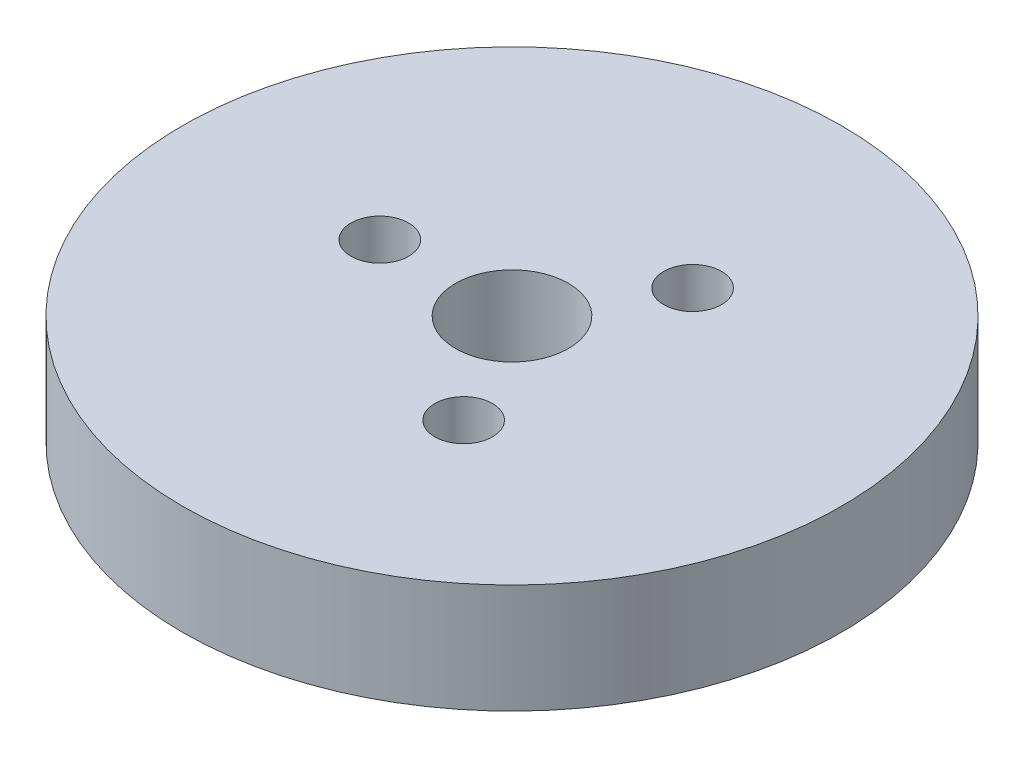
ISO-10303-21;
HEADER;
FILE_DESCRIPTION(('STEP AP214'),'2;1');
FILE_NAME('part.step','',(''),(''),'','','');
FILE_SCHEMA(('AUTOMOTIVE_DESIGN { 1 0 10303 214 1 1 1 1 }'));
ENDSEC;
DATA;
#1=APPLICATION_CONTEXT('core data for automotive mechanical design processes');
#2=APPLICATION_PROTOCOL_DEFINITION('international standard','automotive_design',2000,#1);
#3=PRODUCT_CONTEXT('',#1,'mechanical');
#4=PRODUCT('Part','Part','',(#3));
#5=PRODUCT_RELATED_PRODUCT_CATEGORY('part','',(#4));
#6=PRODUCT_DEFINITION_FORMATION('','',#4);
#7=PRODUCT_DEFINITION_CONTEXT('part definition',#1,'design');
#8=PRODUCT_DEFINITION('design','',#6,#7);
#9=PRODUCT_DEFINITION_SHAPE('','',#8);
#10=(LENGTH_UNIT() NAMED_UNIT(*) SI_UNIT(.MILLI.,.METRE.));
#11=(NAMED_UNIT(*) PLANE_ANGLE_UNIT() SI_UNIT($,.RADIAN.));
#12=(NAMED_UNIT(*) SI_UNIT($,.STERADIAN.) SOLID_ANGLE_UNIT());
#13=UNCERTAINTY_MEASURE_WITH_UNIT(LENGTH_MEASURE(1.E-05),#10,'distance_accuracy_value','');
#14=(GEOMETRIC_REPRESENTATION_CONTEXT(3) GLOBAL_UNCERTAINTY_ASSIGNED_CONTEXT((#13)) GLOBAL_UNIT_ASSIGNED_CONTEXT((#10,
#11,#12)) REPRESENTATION_CONTEXT('',''));
#15=CARTESIAN_POINT('',(0.,0.,0.));
#16=DIRECTION('',(0.,0.,1.));
#17=DIRECTION('',(1.,0.,0.));
#18=AXIS2_PLACEMENT_3D('',#15,#16,#17);
#19=CARTESIAN_POINT('',(0.,29.,0.));
#20=DIRECTION('',(0.,-1.,0.));
#21=DIRECTION('',(0.,0.,-1.));
#22=AXIS2_PLACEMENT_3D('',#19,#20,#21);
#23=CYLINDRICAL_SURFACE('',#22,87.5);
#24=CARTESIAN_POINT('',(0.,29.,0.));
#25=DIRECTION('',(0.,1.,0.));
#26=DIRECTION('',(0.,0.,1.));
#27=AXIS2_PLACEMENT_3D('',#24,#25,#26);
#28=CIRCLE('',#27,87.5);
#29=CARTESIAN_POINT('',(0.,29.,-87.5));
#30=VERTEX_POINT('',#29);
#31=EDGE_CURVE('E10',#30,#30,#28,.T.);
#32=CARTESIAN_POINT('',(0.,0.,0.));
#33=DIRECTION('',(0.,1.,0.));
#34=DIRECTION('',(0.,0.,1.));
#35=AXIS2_PLACEMENT_3D('',#32,#33,#34);
#36=CIRCLE('',#35,87.5);
#37=CARTESIAN_POINT('',(0.,0.,-87.5));
#38=VERTEX_POINT('',#37);
#39=EDGE_CURVE('E37',#38,#38,#36,.T.);
#40=CARTESIAN_POINT('',(0.,29.,-87.5));
#41=CARTESIAN_POINT('',(0.,28.6979166666667,-87.5));
#42=CARTESIAN_POINT('',(0.,28.3958333333333,-87.5));
#43=CARTESIAN_POINT('',(0.,27.7916666666667,-87.5));
#44=CARTESIAN_POINT('',(0.,27.4895833333333,-87.5));
#45=CARTESIAN_POINT('',(0.,26.8854166666667,-87.5));
#46=CARTESIAN_POINT('',(0.,26.5833333333333,-87.5));
#47=CARTESIAN_POINT('',(0.,25.9791666666667,-87.5));
#48=CARTESIAN_POINT('',(0.,25.6770833333333,-87.5));
#49=CARTESIAN_POINT('',(0.,25.0729166666667,-87.5));
#50=CARTESIAN_POINT('',(0.,24.7708333333333,-87.5));
#51=CARTESIAN_POINT('',(0.,24.1666666666667,-87.5));
#52=CARTESIAN_POINT('',(0.,23.8645833333333,-87.5));
#53=CARTESIAN_POINT('',(0.,23.2604166666667,-87.5));
#54=CARTESIAN_POINT('',(0.,22.9583333333333,-87.5));
#55=CARTESIAN_POINT('',(0.,22.3541666666667,-87.5));
#56=CARTESIAN_POINT('',(0.,22.0520833333333,-87.5));
#57=CARTESIAN_POINT('',(0.,21.4479166666667,-87.5));
#58=CARTESIAN_POINT('',(0.,21.1458333333333,-87.5));
#59=CARTESIAN_POINT('',(0.,20.5416666666667,-87.5));
#60=CARTESIAN_POINT('',(0.,20.2395833333333,-87.5));
#61=CARTESIAN_POINT('',(0.,19.6354166666667,-87.5));
#62=CARTESIAN_POINT('',(0.,19.3333333333333,-87.5));
#63=CARTESIAN_POINT('',(0.,18.7291666666667,-87.5));
#64=CARTESIAN_POINT('',(0.,18.4270833333333,-87.5));
#65=CARTESIAN_POINT('',(0.,17.8229166666667,-87.5));
#66=CARTESIAN_POINT('',(0.,17.5208333333333,-87.5));
#67=CARTESIAN_POINT('',(0.,16.9166666666667,-87.5));
#68=CARTESIAN_POINT('',(0.,16.6145833333333,-87.5));
#69=CARTESIAN_POINT('',(0.,16.0104166666667,-87.5));
#70=CARTESIAN_POINT('',(0.,15.7083333333333,-87.5));
#71=CARTESIAN_POINT('',(0.,15.1041666666667,-87.5));
#72=CARTESIAN_POINT('',(0.,14.8020833333333,-87.5));
#73=CARTESIAN_POINT('',(0.,14.1979166666667,-87.5));
#74=CARTESIAN_POINT('',(0.,13.8958333333333,-87.5));
#75=CARTESIAN_POINT('',(0.,13.2916666666667,-87.5));
#76=CARTESIAN_POINT('',(0.,12.9895833333333,-87.5));
#77=CARTESIAN_POINT('',(0.,12.3854166666667,-87.5));
#78=CARTESIAN_POINT('',(0.,12.0833333333333,-87.5));
#79=CARTESIAN_POINT('',(0.,11.4791666666667,-87.5));
#80=CARTESIAN_POINT('',(0.,11.1770833333333,-87.5));
#81=CARTESIAN_POINT('',(0.,10.5729166666667,-87.5));
#82=CARTESIAN_POINT('',(0.,10.2708333333333,-87.5));
#83=CARTESIAN_POINT('',(0.,9.66666666666667,-87.5));
#84=CARTESIAN_POINT('',(0.,9.36458333333333,-87.5));
#85=CARTESIAN_POINT('',(0.,8.76041666666667,-87.5));
#86=CARTESIAN_POINT('',(0.,8.45833333333333,-87.5));
#87=CARTESIAN_POINT('',(0.,7.85416666666667,-87.5));
#88=CARTESIAN_POINT('',(0.,7.55208333333333,-87.5));
#89=CARTESIAN_POINT('',(0.,6.94791666666667,-87.5));
#90=CARTESIAN_POINT('',(0.,6.64583333333333,-87.5));
#91=CARTESIAN_POINT('',(0.,6.04166666666667,-87.5));
#92=CARTESIAN_POINT('',(0.,5.73958333333333,-87.5));
#93=CARTESIAN_POINT('',(0.,5.13541666666667,-87.5));
#94=CARTESIAN_POINT('',(0.,4.83333333333333,-87.5));
#95=CARTESIAN_POINT('',(0.,4.22916666666667,-87.5));
#96=CARTESIAN_POINT('',(0.,3.92708333333333,-87.5));
#97=CARTESIAN_POINT('',(0.,3.32291666666667,-87.5));
#98=CARTESIAN_POINT('',(0.,3.02083333333333,-87.5));
#99=CARTESIAN_POINT('',(0.,2.41666666666667,-87.5));
#100=CARTESIAN_POINT('',(0.,2.11458333333333,-87.5));
#101=CARTESIAN_POINT('',(0.,1.51041666666667,-87.5));
#102=CARTESIAN_POINT('',(0.,1.20833333333333,-87.5));
#103=CARTESIAN_POINT('',(0.,0.604166666666667,-87.5));
#104=CARTESIAN_POINT('',(0.,0.302083333333333,-87.5));
#105=CARTESIAN_POINT('',(0.,0.,-87.5));
#106=B_SPLINE_CURVE_WITH_KNOTS('',3,(#40,#41,#42,#43,#44,#45,#46,#47,#48,#49,#50,#51,#52,#53,
#54,#55,#56,#57,#58,#59,#60,#61,#62,#63,#64,#65,#66,#67,#68,#69,#70,#71,#72,#73,#74,#75,#76,#77,
#78,#79,#80,#81,#82,#83,#84,#85,#86,#87,#88,#89,#90,#91,#92,#93,#94,#95,#96,#97,#98,#99,#100,
#101,#102,#103,#104,#105),.UNSPECIFIED.,.F.,.F.,(4,2,2,2,2,2,2,2,2,2,2,2,2,2,2,2,2,2,2,2,2,2,2,
2,2,2,2,2,2,2,2,2,4),(0.,0.906249999999997,1.8125,2.71875,3.625,4.53125,5.4375,6.34375,7.25,
8.15625,9.0625,9.96875,10.875,11.78125,12.6875,13.59375,14.5,15.40625,16.3125,17.21875,18.125,
19.03125,19.9375,20.84375,21.75,22.65625,23.5625,24.46875,25.375,26.28125,27.1875,28.09375,29.),.UNSPECIFIED.);
#107=EDGE_CURVE('BSEAM40',#30,#38,#106,.T.);
#108=ORIENTED_EDGE('',*,*,#31,.F.);
#109=ORIENTED_EDGE('',*,*,#39,.T.);
#110=ORIENTED_EDGE('',*,*,#107,.T.);
#111=ORIENTED_EDGE('',*,*,#107,.F.);
#112=EDGE_LOOP('',(#108,#110,#109,#111));
#113=FACE_BOUND('',#112,.T.);
#114=ADVANCED_FACE('F40',(#113),#23,.T.);
#115=CARTESIAN_POINT('',(0.,29.,0.));
#116=DIRECTION('',(0.,1.,0.));
#117=DIRECTION('',(0.,0.,1.));
#118=AXIS2_PLACEMENT_3D('',#115,#116,#117);
#119=PLANE('',#118);
#120=CARTESIAN_POINT('',(17.5471963072202,29.,30.39263553449));
#121=DIRECTION('',(0.,1.,0.));
#122=DIRECTION('',(0.866025403784436,0.,-0.500000000000004));
#123=AXIS2_PLACEMENT_3D('',#120,#121,#122);
#124=CIRCLE('',#123,7.66698889306709);
#125=CARTESIAN_POINT('',(24.1870034591494,29.,26.5591410879564));
#126=VERTEX_POINT('',#125);
#127=EDGE_CURVE('E70',#126,#126,#124,.T.);
#128=ORIENTED_EDGE('',*,*,#127,.F.);
#129=EDGE_LOOP('',(#128));
#130=FACE_BOUND('',#129,.T.);
#131=CARTESIAN_POINT('',(17.5471963072197,29.,-30.3926355344902));
#132=DIRECTION('',(0.,1.,0.));
#133=DIRECTION('',(-0.866025403784443,0.,-0.499999999999992));
#134=AXIS2_PLACEMENT_3D('',#131,#132,#133);
#135=CIRCLE('',#134,7.66698889306709);
#136=CARTESIAN_POINT('',(10.9073891552905,29.,-34.2261299810237));
#137=VERTEX_POINT('',#136);
#138=EDGE_CURVE('E61',#137,#137,#135,.T.);
#139=ORIENTED_EDGE('',*,*,#138,.F.);
#140=EDGE_LOOP('',(#139));
#141=FACE_BOUND('',#140,.T.);
#142=CARTESIAN_POINT('',(-35.0943926144401,29.,0.));
#143=DIRECTION('',(0.,1.,0.));
#144=DIRECTION('',(0.,0.,1.));
#145=AXIS2_PLACEMENT_3D('',#142,#143,#144);
#146=CIRCLE('',#145,7.66698889306709);
#147=CARTESIAN_POINT('',(-35.0943926144401,29.,7.66698889306709));
#148=VERTEX_POINT('',#147);
#149=EDGE_CURVE('E54',#148,#148,#146,.T.);
#150=ORIENTED_EDGE('',*,*,#149,.F.);
#151=EDGE_LOOP('',(#150));
#152=FACE_BOUND('',#151,.T.);
#153=CARTESIAN_POINT('',(0.,29.,0.));
#154=DIRECTION('',(0.,1.,0.));
#155=DIRECTION('',(0.,0.,1.));
#156=AXIS2_PLACEMENT_3D('',#153,#154,#155);
#157=CIRCLE('',#156,15.);
#158=CARTESIAN_POINT('',(0.,29.,-15.));
#159=VERTEX_POINT('',#158);
#160=EDGE_CURVE('E50',#159,#159,#157,.T.);
#161=ORIENTED_EDGE('',*,*,#160,.F.);
#162=EDGE_LOOP('',(#161));
#163=FACE_BOUND('',#162,.T.);
#164=ORIENTED_EDGE('',*,*,#31,.T.);
#165=EDGE_LOOP('',(#164));
#166=FACE_BOUND('',#165,.T.);
#167=ADVANCED_FACE('F85',(#130,#141,#152,#163,#166),#119,.T.);
#168=CARTESIAN_POINT('',(0.,0.,0.));
#169=DIRECTION('',(0.,1.,0.));
#170=DIRECTION('',(0.,0.,1.));
#171=AXIS2_PLACEMENT_3D('',#168,#169,#170);
#172=PLANE('',#171);
#173=CARTESIAN_POINT('',(0.,0.,0.));
#174=DIRECTION('',(0.,1.,0.));
#175=DIRECTION('',(0.,0.,1.));
#176=AXIS2_PLACEMENT_3D('',#173,#174,#175);
#177=CIRCLE('',#176,15.);
#178=CARTESIAN_POINT('',(0.,0.,-15.));
#179=VERTEX_POINT('',#178);
#180=EDGE_CURVE('E47',#179,#179,#177,.T.);
#181=ORIENTED_EDGE('',*,*,#180,.T.);
#182=EDGE_LOOP('',(#181));
#183=FACE_BOUND('',#182,.T.);
#184=ORIENTED_EDGE('',*,*,#39,.F.);
#185=EDGE_LOOP('',(#184));
#186=FACE_BOUND('',#185,.T.);
#187=ADVANCED_FACE('F84',(#183,#186),#172,.F.);
#188=CARTESIAN_POINT('',(0.,29.,0.));
#189=DIRECTION('',(0.,-1.,0.));
#190=DIRECTION('',(0.,0.,-1.));
#191=AXIS2_PLACEMENT_3D('',#188,#189,#190);
#192=CYLINDRICAL_SURFACE('',#191,15.);
#193=CARTESIAN_POINT('',(0.,29.,-15.));
#194=CARTESIAN_POINT('',(0.,28.6979166666667,-15.));
#195=CARTESIAN_POINT('',(0.,28.3958333333333,-15.));
#196=CARTESIAN_POINT('',(0.,27.7916666666667,-15.));
#197=CARTESIAN_POINT('',(0.,27.4895833333333,-15.));
#198=CARTESIAN_POINT('',(0.,26.8854166666667,-15.));
#199=CARTESIAN_POINT('',(0.,26.5833333333333,-15.));
#200=CARTESIAN_POINT('',(0.,25.9791666666667,-15.));
#201=CARTESIAN_POINT('',(0.,25.6770833333333,-15.));
#202=CARTESIAN_POINT('',(0.,25.0729166666667,-15.));
#203=CARTESIAN_POINT('',(0.,24.7708333333333,-15.));
#204=CARTESIAN_POINT('',(0.,24.1666666666667,-15.));
#205=CARTESIAN_POINT('',(0.,23.8645833333333,-15.));
#206=CARTESIAN_POINT('',(0.,23.2604166666667,-15.));
#207=CARTESIAN_POINT('',(0.,22.9583333333333,-15.));
#208=CARTESIAN_POINT('',(0.,22.3541666666667,-15.));
#209=CARTESIAN_POINT('',(0.,22.0520833333333,-15.));
#210=CARTESIAN_POINT('',(0.,21.4479166666667,-15.));
#211=CARTESIAN_POINT('',(0.,21.1458333333333,-15.));
#212=CARTESIAN_POINT('',(0.,20.5416666666667,-15.));
#213=CARTESIAN_POINT('',(0.,20.2395833333333,-15.));
#214=CARTESIAN_POINT('',(0.,19.6354166666667,-15.));
#215=CARTESIAN_POINT('',(0.,19.3333333333333,-15.));
#216=CARTESIAN_POINT('',(0.,18.7291666666667,-15.));
#217=CARTESIAN_POINT('',(0.,18.4270833333333,-15.));
#218=CARTESIAN_POINT('',(0.,17.8229166666667,-15.));
#219=CARTESIAN_POINT('',(0.,17.5208333333333,-15.));
#220=CARTESIAN_POINT('',(0.,16.9166666666667,-15.));
#221=CARTESIAN_POINT('',(0.,16.6145833333333,-15.));
#222=CARTESIAN_POINT('',(0.,16.0104166666667,-15.));
#223=CARTESIAN_POINT('',(0.,15.7083333333333,-15.));
#224=CARTESIAN_POINT('',(0.,15.1041666666667,-15.));
#225=CARTESIAN_POINT('',(0.,14.8020833333333,-15.));
#226=CARTESIAN_POINT('',(0.,14.1979166666667,-15.));
#227=CARTESIAN_POINT('',(0.,13.8958333333333,-15.));
#228=CARTESIAN_POINT('',(0.,13.2916666666667,-15.));
#229=CARTESIAN_POINT('',(0.,12.9895833333333,-15.));
#230=CARTESIAN_POINT('',(0.,12.3854166666667,-15.));
#231=CARTESIAN_POINT('',(0.,12.0833333333333,-15.));
#232=CARTESIAN_POINT('',(0.,11.4791666666667,-15.));
#233=CARTESIAN_POINT('',(0.,11.1770833333333,-15.));
#234=CARTESIAN_POINT('',(0.,10.5729166666667,-15.));
#235=CARTESIAN_POINT('',(0.,10.2708333333333,-15.));
#236=CARTESIAN_POINT('',(0.,9.66666666666667,-15.));
#237=CARTESIAN_POINT('',(0.,9.36458333333333,-15.));
#238=CARTESIAN_POINT('',(0.,8.76041666666667,-15.));
#239=CARTESIAN_POINT('',(0.,8.45833333333333,-15.));
#240=CARTESIAN_POINT('',(0.,7.85416666666667,-15.));
#241=CARTESIAN_POINT('',(0.,7.55208333333333,-15.));
#242=CARTESIAN_POINT('',(0.,6.94791666666667,-15.));
#243=CARTESIAN_POINT('',(0.,6.64583333333333,-15.));
#244=CARTESIAN_POINT('',(0.,6.04166666666667,-15.));
#245=CARTESIAN_POINT('',(0.,5.73958333333333,-15.));
#246=CARTESIAN_POINT('',(0.,5.13541666666667,-15.));
#247=CARTESIAN_POINT('',(0.,4.83333333333333,-15.));
#248=CARTESIAN_POINT('',(0.,4.22916666666667,-15.));
#249=CARTESIAN_POINT('',(0.,3.92708333333333,-15.));
#250=CARTESIAN_POINT('',(0.,3.32291666666667,-15.));
#251=CARTESIAN_POINT('',(0.,3.02083333333333,-15.));
#252=CARTESIAN_POINT('',(0.,2.41666666666667,-15.));
#253=CARTESIAN_POINT('',(0.,2.11458333333333,-15.));
#254=CARTESIAN_POINT('',(0.,1.51041666666667,-15.));
#255=CARTESIAN_POINT('',(0.,1.20833333333333,-15.));
#256=CARTESIAN_POINT('',(0.,0.604166666666667,-15.));
#257=CARTESIAN_POINT('',(0.,0.302083333333333,-15.));
#258=CARTESIAN_POINT('',(0.,0.,-15.));
#259=B_SPLINE_CURVE_WITH_KNOTS('',3,(#193,#194,#195,#196,#197,#198,#199,#200,#201,#202,#203,
#204,#205,#206,#207,#208,#209,#210,#211,#212,#213,#214,#215,#216,#217,#218,#219,#220,#221,#222,
#223,#224,#225,#226,#227,#228,#229,#230,#231,#232,#233,#234,#235,#236,#237,#238,#239,#240,#241,
#242,#243,#244,#245,#246,#247,#248,#249,#250,#251,#252,#253,#254,#255,#256,#257,#258),
.UNSPECIFIED.,.F.,.F.,(4,2,2,2,2,2,2,2,2,2,2,2,2,2,2,2,2,2,2,2,2,2,2,2,2,2,2,2,2,2,2,2,4),(0.,
0.906250000000001,1.8125,2.71875,3.625,4.53125,5.4375,6.34375,7.25,8.15625,9.0625,9.96875,
10.875,11.78125,12.6875,13.59375,14.5,15.40625,16.3125,17.21875,18.125,19.03125,19.9375,
20.84375,21.75,22.65625,23.5625,24.46875,25.375,26.28125,27.1875,28.09375,29.),.UNSPECIFIED.);
#260=EDGE_CURVE('BSEAM91',#159,#179,#259,.T.);
#261=ORIENTED_EDGE('',*,*,#160,.T.);
#262=ORIENTED_EDGE('',*,*,#180,.F.);
#263=ORIENTED_EDGE('',*,*,#260,.T.);
#264=ORIENTED_EDGE('',*,*,#260,.F.);
#265=EDGE_LOOP('',(#261,#263,#262,#264));
#266=FACE_BOUND('',#265,.T.);
#267=ADVANCED_FACE('F91',(#266),#192,.F.);
#268=CARTESIAN_POINT('',(-35.0943926144401,7.77837517522895,0.));
#269=DIRECTION('',(0.,1.,0.));
#270=DIRECTION('',(0.,0.,1.));
#271=AXIS2_PLACEMENT_3D('',#268,#269,#270);
#272=CYLINDRICAL_SURFACE('',#271,7.66698889306709);
#273=CARTESIAN_POINT('',(-35.0943926144401,7.77837517522895,0.));
#274=DIRECTION('',(0.,1.,0.));
#275=DIRECTION('',(0.,0.,1.));
#276=AXIS2_PLACEMENT_3D('',#273,#274,#275);
#277=CIRCLE('',#276,7.66698889306709);
#278=CARTESIAN_POINT('',(-35.0943926144401,7.77837517522895,7.66698889306709));
#279=VERTEX_POINT('',#278);
#280=EDGE_CURVE('E55',#279,#279,#277,.T.);
#281=ORIENTED_EDGE('',*,*,#280,.F.);
#282=EDGE_LOOP('',(#281));
#283=FACE_BOUND('',#282,.T.);
#284=ORIENTED_EDGE('',*,*,#149,.T.);
#285=EDGE_LOOP('',(#284));
#286=FACE_BOUND('',#285,.T.);
#287=ADVANCED_FACE('F96',(#283,#286),#272,.F.);
#288=CARTESIAN_POINT('',(-35.0943926144401,7.77837517522895,0.));
#289=DIRECTION('',(0.,1.,0.));
#290=DIRECTION('',(0.,0.,1.));
#291=AXIS2_PLACEMENT_3D('',#288,#289,#290);
#292=PLANE('',#291);
#293=ORIENTED_EDGE('',*,*,#280,.T.);
#294=EDGE_LOOP('',(#293));
#295=FACE_BOUND('',#294,.T.);
#296=ADVANCED_FACE('F127',(#295),#292,.T.);
#297=CARTESIAN_POINT('',(17.5471963072197,7.77837517522895,-30.3926355344902));
#298=DIRECTION('',(0.,1.,0.));
#299=DIRECTION('',(0.,0.,1.));
#300=AXIS2_PLACEMENT_3D('',#297,#298,#299);
#301=CYLINDRICAL_SURFACE('',#300,7.66698889306709);
#302=CARTESIAN_POINT('',(17.5471963072197,7.77837517522895,-30.3926355344902));
#303=DIRECTION('',(0.,1.,0.));
#304=DIRECTION('',(-0.866025403784443,0.,-0.499999999999992));
#305=AXIS2_PLACEMENT_3D('',#302,#303,#304);
#306=CIRCLE('',#305,7.66698889306709);
#307=CARTESIAN_POINT('',(10.9073891552905,7.77837517522895,-34.2261299810237));
#308=VERTEX_POINT('',#307);
#309=EDGE_CURVE('E63',#308,#308,#306,.T.);
#310=ORIENTED_EDGE('',*,*,#309,.F.);
#311=EDGE_LOOP('',(#310));
#312=FACE_BOUND('',#311,.T.);
#313=ORIENTED_EDGE('',*,*,#138,.T.);
#314=EDGE_LOOP('',(#313));
#315=FACE_BOUND('',#314,.T.);
#316=ADVANCED_FACE('F133',(#312,#315),#301,.F.);
#317=CARTESIAN_POINT('',(17.5471963072197,7.77837517522895,-30.3926355344902));
#318=DIRECTION('',(0.,1.,0.));
#319=DIRECTION('',(-0.866025403784443,0.,-0.499999999999992));
#320=AXIS2_PLACEMENT_3D('',#317,#318,#319);
#321=PLANE('',#320);
#322=ORIENTED_EDGE('',*,*,#309,.T.);
#323=EDGE_LOOP('',(#322));
#324=FACE_BOUND('',#323,.T.);
#325=ADVANCED_FACE('F77',(#324),#321,.T.);
#326=CARTESIAN_POINT('',(17.5471963072202,7.77837517522895,30.39263553449));
#327=DIRECTION('',(0.,1.,0.));
#328=DIRECTION('',(0.,0.,1.));
#329=AXIS2_PLACEMENT_3D('',#326,#327,#328);
#330=CYLINDRICAL_SURFACE('',#329,7.66698889306709);
#331=CARTESIAN_POINT('',(17.5471963072202,7.77837517522895,30.39263553449));
#332=DIRECTION('',(0.,1.,0.));
#333=DIRECTION('',(0.866025403784436,0.,-0.500000000000004));
#334=AXIS2_PLACEMENT_3D('',#331,#332,#333);
#335=CIRCLE('',#334,7.66698889306709);
#336=CARTESIAN_POINT('',(24.1870034591494,7.77837517522895,26.5591410879564));
#337=VERTEX_POINT('',#336);
#338=EDGE_CURVE('E59',#337,#337,#335,.T.);
#339=ORIENTED_EDGE('',*,*,#338,.F.);
#340=EDGE_LOOP('',(#339));
#341=FACE_BOUND('',#340,.T.);
#342=ORIENTED_EDGE('',*,*,#127,.T.);
#343=EDGE_LOOP('',(#342));
#344=FACE_BOUND('',#343,.T.);
#345=ADVANCED_FACE('F73',(#341,#344),#330,.F.);
#346=CARTESIAN_POINT('',(17.5471963072202,7.77837517522895,30.39263553449));
#347=DIRECTION('',(0.,1.,0.));
#348=DIRECTION('',(0.866025403784436,0.,-0.500000000000004));
#349=AXIS2_PLACEMENT_3D('',#346,#347,#348);
#350=PLANE('',#349);
#351=ORIENTED_EDGE('',*,*,#338,.T.);
#352=EDGE_LOOP('',(#351));
#353=FACE_BOUND('',#352,.T.);
#354=ADVANCED_FACE('F71',(#353),#350,.T.);
#355=CLOSED_SHELL('',(#114,#167,#187,#267,#287,#296,#316,#325,#345,#354));
#356=MANIFOLD_SOLID_BREP('B2',#355);
#357=ADVANCED_BREP_SHAPE_REPRESENTATION('',(#18,#356),#14);
#358=SHAPE_DEFINITION_REPRESENTATION(#9,#357);
ENDSEC;
END-ISO-10303-21;
